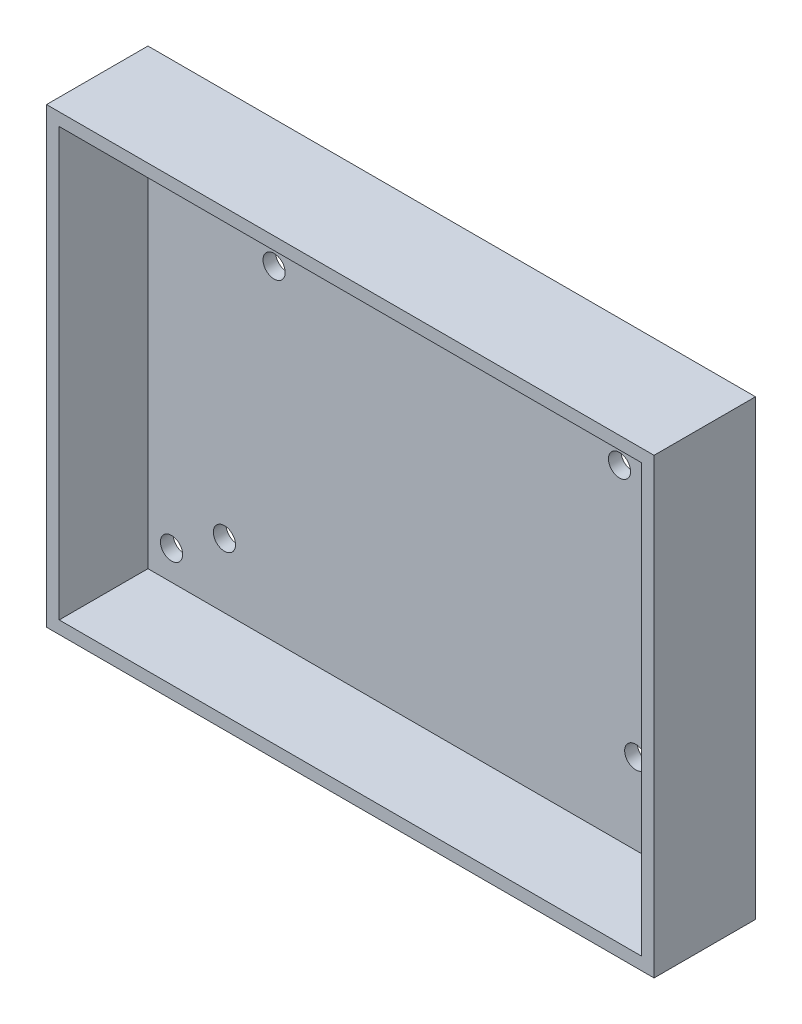
ISO-10303-21;
HEADER;
FILE_DESCRIPTION(('STEP AP214'),'2;1');
FILE_NAME('part.step','',(''),(''),'','','');
FILE_SCHEMA(('AUTOMOTIVE_DESIGN { 1 0 10303 214 1 1 1 1 }'));
ENDSEC;
DATA;
#1=APPLICATION_CONTEXT('core data for automotive mechanical design processes');
#2=APPLICATION_PROTOCOL_DEFINITION('international standard','automotive_design',2000,#1);
#3=PRODUCT_CONTEXT('',#1,'mechanical');
#4=PRODUCT('Part','Part','',(#3));
#5=PRODUCT_RELATED_PRODUCT_CATEGORY('part','',(#4));
#6=PRODUCT_DEFINITION_FORMATION('','',#4);
#7=PRODUCT_DEFINITION_CONTEXT('part definition',#1,'design');
#8=PRODUCT_DEFINITION('design','',#6,#7);
#9=PRODUCT_DEFINITION_SHAPE('','',#8);
#10=(LENGTH_UNIT() NAMED_UNIT(*) SI_UNIT(.MILLI.,.METRE.));
#11=(NAMED_UNIT(*) PLANE_ANGLE_UNIT() SI_UNIT($,.RADIAN.));
#12=(NAMED_UNIT(*) SI_UNIT($,.STERADIAN.) SOLID_ANGLE_UNIT());
#13=UNCERTAINTY_MEASURE_WITH_UNIT(LENGTH_MEASURE(1.E-05),#10,'distance_accuracy_value','');
#14=(GEOMETRIC_REPRESENTATION_CONTEXT(3) GLOBAL_UNCERTAINTY_ASSIGNED_CONTEXT((#13)) GLOBAL_UNIT_ASSIGNED_CONTEXT((#10,
#11,#12)) REPRESENTATION_CONTEXT('',''));
#15=CARTESIAN_POINT('',(0.,0.,0.));
#16=DIRECTION('',(0.,0.,1.));
#17=DIRECTION('',(1.,0.,0.));
#18=AXIS2_PLACEMENT_3D('',#15,#16,#17);
#19=CARTESIAN_POINT('',(259.442010442395,0.,4.));
#20=DIRECTION('',(1.,0.,0.));
#21=DIRECTION('',(0.,0.,-1.));
#22=AXIS2_PLACEMENT_3D('',#19,#20,#21);
#23=PLANE('',#22);
#24=DIRECTION('',(0.,-1.,0.));
#25=VECTOR('',#24,1.);
#26=CARTESIAN_POINT('',(259.442010442395,0.,0.));
#27=LINE('',#26,#25);
#28=CARTESIAN_POINT('',(259.442010442395,69.8459266842503,0.));
#29=VERTEX_POINT('',#28);
#30=CARTESIAN_POINT('',(259.442010442395,-73.,0.));
#31=VERTEX_POINT('',#30);
#32=EDGE_CURVE('E199',#29,#31,#27,.T.);
#33=ORIENTED_EDGE('',*,*,#32,.F.);
#34=DIRECTION('',(0.,0.,-1.));
#35=VECTOR('',#34,1.);
#36=CARTESIAN_POINT('',(259.442010442395,69.8459266842503,4.));
#37=LINE('',#36,#35);
#38=CARTESIAN_POINT('',(259.442010442395,69.8459266842503,32.));
#39=VERTEX_POINT('',#38);
#40=EDGE_CURVE('E11',#39,#29,#37,.T.);
#41=ORIENTED_EDGE('',*,*,#40,.F.);
#42=DIRECTION('',(0.,-1.,0.));
#43=VECTOR('',#42,1.);
#44=CARTESIAN_POINT('',(259.442010442395,0.,32.));
#45=LINE('',#44,#43);
#46=CARTESIAN_POINT('',(259.442010442395,-73.,32.));
#47=VERTEX_POINT('',#46);
#48=EDGE_CURVE('E127',#39,#47,#45,.T.);
#49=ORIENTED_EDGE('',*,*,#48,.T.);
#50=DIRECTION('',(0.,0.,-1.));
#51=VECTOR('',#50,1.);
#52=CARTESIAN_POINT('',(259.442010442395,-73.,4.));
#53=LINE('',#52,#51);
#54=EDGE_CURVE('E55',#47,#31,#53,.T.);
#55=ORIENTED_EDGE('',*,*,#54,.T.);
#56=EDGE_LOOP('',(#33,#41,#49,#55));
#57=FACE_BOUND('',#56,.T.);
#58=ADVANCED_FACE('F32',(#57),#23,.T.);
#59=CARTESIAN_POINT('',(0.,69.8459266842503,4.));
#60=DIRECTION('',(0.,1.,0.));
#61=DIRECTION('',(0.,0.,1.));
#62=AXIS2_PLACEMENT_3D('',#59,#60,#61);
#63=PLANE('',#62);
#64=DIRECTION('',(1.,0.,0.));
#65=VECTOR('',#64,1.);
#66=CARTESIAN_POINT('',(0.,69.8459266842503,0.));
#67=LINE('',#66,#65);
#68=CARTESIAN_POINT('',(67.7326460465509,69.8459266842503,0.));
#69=VERTEX_POINT('',#68);
#70=EDGE_CURVE('E202',#69,#29,#67,.T.);
#71=ORIENTED_EDGE('',*,*,#70,.F.);
#72=DIRECTION('',(0.,0.,-1.));
#73=VECTOR('',#72,1.);
#74=CARTESIAN_POINT('',(67.7326460465509,69.8459266842503,4.));
#75=LINE('',#74,#73);
#76=CARTESIAN_POINT('',(67.7326460465509,69.8459266842503,32.));
#77=VERTEX_POINT('',#76);
#78=EDGE_CURVE('E40',#77,#69,#75,.T.);
#79=ORIENTED_EDGE('',*,*,#78,.F.);
#80=DIRECTION('',(1.,0.,0.));
#81=VECTOR('',#80,1.);
#82=CARTESIAN_POINT('',(0.,69.8459266842503,32.));
#83=LINE('',#82,#81);
#84=EDGE_CURVE('E129',#77,#39,#83,.T.);
#85=ORIENTED_EDGE('',*,*,#84,.T.);
#86=ORIENTED_EDGE('',*,*,#40,.T.);
#87=EDGE_LOOP('',(#71,#79,#85,#86));
#88=FACE_BOUND('',#87,.T.);
#89=ADVANCED_FACE('F221',(#88),#63,.T.);
#90=CARTESIAN_POINT('',(67.7326460465509,0.,4.));
#91=DIRECTION('',(1.,0.,0.));
#92=DIRECTION('',(0.,1.,0.));
#93=AXIS2_PLACEMENT_3D('',#90,#91,#92);
#94=PLANE('',#93);
#95=DIRECTION('',(0.,-1.,0.));
#96=VECTOR('',#95,1.);
#97=CARTESIAN_POINT('',(67.7326460465509,0.,0.));
#98=LINE('',#97,#96);
#99=CARTESIAN_POINT('',(67.732646046551,-73.,0.));
#100=VERTEX_POINT('',#99);
#101=EDGE_CURVE('E205',#69,#100,#98,.T.);
#102=ORIENTED_EDGE('',*,*,#101,.T.);
#103=DIRECTION('',(0.,0.,-1.));
#104=VECTOR('',#103,1.);
#105=CARTESIAN_POINT('',(67.732646046551,-73.,4.));
#106=LINE('',#105,#104);
#107=CARTESIAN_POINT('',(67.732646046551,-73.,32.));
#108=VERTEX_POINT('',#107);
#109=EDGE_CURVE('E210',#108,#100,#106,.T.);
#110=ORIENTED_EDGE('',*,*,#109,.F.);
#111=DIRECTION('',(0.,-1.,0.));
#112=VECTOR('',#111,1.);
#113=CARTESIAN_POINT('',(67.7326460465509,0.,32.));
#114=LINE('',#113,#112);
#115=EDGE_CURVE('E132',#77,#108,#114,.T.);
#116=ORIENTED_EDGE('',*,*,#115,.F.);
#117=ORIENTED_EDGE('',*,*,#78,.T.);
#118=EDGE_LOOP('',(#102,#110,#116,#117));
#119=FACE_BOUND('',#118,.T.);
#120=ADVANCED_FACE('F215',(#119),#94,.F.);
#121=CARTESIAN_POINT('',(94.9732218432676,44.7663416960383,4.));
#122=DIRECTION('',(0.,0.,-1.));
#123=DIRECTION('',(-1.,0.,0.));
#124=AXIS2_PLACEMENT_3D('',#121,#122,#123);
#125=CYLINDRICAL_SURFACE('',#124,3.50000000000005);
#126=CARTESIAN_POINT('',(94.9732218432676,44.7663416960383,4.));
#127=DIRECTION('',(0.,0.,1.));
#128=DIRECTION('',(1.,0.,0.));
#129=AXIS2_PLACEMENT_3D('',#126,#127,#128);
#130=CIRCLE('',#129,3.50000000000005);
#131=CARTESIAN_POINT('',(98.4732218432676,44.7663416960383,4.));
#132=VERTEX_POINT('',#131);
#133=EDGE_CURVE('E173',#132,#132,#130,.T.);
#134=ORIENTED_EDGE('',*,*,#133,.T.);
#135=EDGE_LOOP('',(#134));
#136=FACE_BOUND('',#135,.T.);
#137=CARTESIAN_POINT('',(94.9732218432676,44.7663416960383,0.));
#138=DIRECTION('',(0.,0.,1.));
#139=DIRECTION('',(1.,0.,0.));
#140=AXIS2_PLACEMENT_3D('',#137,#138,#139);
#141=CIRCLE('',#140,3.50000000000005);
#142=CARTESIAN_POINT('',(98.4732218432676,44.7663416960383,0.));
#143=VERTEX_POINT('',#142);
#144=EDGE_CURVE('E196',#143,#143,#141,.T.);
#145=ORIENTED_EDGE('',*,*,#144,.F.);
#146=EDGE_LOOP('',(#145));
#147=FACE_BOUND('',#146,.T.);
#148=ADVANCED_FACE('F231',(#136,#147),#125,.F.);
#149=CARTESIAN_POINT('',(111.546962378698,33.5720965377341,4.));
#150=DIRECTION('',(0.,0.,-1.));
#151=DIRECTION('',(-1.,0.,0.));
#152=AXIS2_PLACEMENT_3D('',#149,#150,#151);
#153=CYLINDRICAL_SURFACE('',#152,3.49999999999999);
#154=CARTESIAN_POINT('',(111.546962378698,33.5720965377341,4.));
#155=DIRECTION('',(0.,0.,1.));
#156=DIRECTION('',(1.,0.,0.));
#157=AXIS2_PLACEMENT_3D('',#154,#155,#156);
#158=CIRCLE('',#157,3.49999999999999);
#159=CARTESIAN_POINT('',(115.046962378698,33.5720965377341,4.));
#160=VERTEX_POINT('',#159);
#161=EDGE_CURVE('E170',#160,#160,#158,.T.);
#162=ORIENTED_EDGE('',*,*,#161,.T.);
#163=EDGE_LOOP('',(#162));
#164=FACE_BOUND('',#163,.T.);
#165=CARTESIAN_POINT('',(111.546962378698,33.5720965377341,0.));
#166=DIRECTION('',(0.,0.,1.));
#167=DIRECTION('',(1.,0.,0.));
#168=AXIS2_PLACEMENT_3D('',#165,#166,#167);
#169=CIRCLE('',#168,3.49999999999999);
#170=CARTESIAN_POINT('',(115.046962378698,33.5720965377341,0.));
#171=VERTEX_POINT('',#170);
#172=EDGE_CURVE('E193',#171,#171,#169,.T.);
#173=ORIENTED_EDGE('',*,*,#172,.F.);
#174=EDGE_LOOP('',(#173));
#175=FACE_BOUND('',#174,.T.);
#176=ADVANCED_FACE('F234',(#164,#175),#153,.F.);
#177=CARTESIAN_POINT('',(220.528931490542,33.6859814718858,4.));
#178=DIRECTION('',(0.,0.,-1.));
#179=DIRECTION('',(-1.,0.,0.));
#180=AXIS2_PLACEMENT_3D('',#177,#178,#179);
#181=CYLINDRICAL_SURFACE('',#180,3.49999999999999);
#182=CARTESIAN_POINT('',(220.528931490542,33.6859814718858,4.));
#183=DIRECTION('',(0.,0.,1.));
#184=DIRECTION('',(1.,0.,0.));
#185=AXIS2_PLACEMENT_3D('',#182,#183,#184);
#186=CIRCLE('',#185,3.49999999999999);
#187=CARTESIAN_POINT('',(224.028931490542,33.6859814718858,4.));
#188=VERTEX_POINT('',#187);
#189=EDGE_CURVE('E167',#188,#188,#186,.T.);
#190=ORIENTED_EDGE('',*,*,#189,.T.);
#191=EDGE_LOOP('',(#190));
#192=FACE_BOUND('',#191,.T.);
#193=CARTESIAN_POINT('',(220.528931490542,33.6859814718858,0.));
#194=DIRECTION('',(0.,0.,1.));
#195=DIRECTION('',(1.,0.,0.));
#196=AXIS2_PLACEMENT_3D('',#193,#194,#195);
#197=CIRCLE('',#196,3.49999999999999);
#198=CARTESIAN_POINT('',(224.028931490542,33.6859814718858,0.));
#199=VERTEX_POINT('',#198);
#200=EDGE_CURVE('E190',#199,#199,#197,.T.);
#201=ORIENTED_EDGE('',*,*,#200,.F.);
#202=EDGE_LOOP('',(#201));
#203=FACE_BOUND('',#202,.T.);
#204=ADVANCED_FACE('F238',(#192,#203),#181,.F.);
#205=CARTESIAN_POINT('',(237.216888789833,44.7092333141085,4.));
#206=DIRECTION('',(0.,0.,-1.));
#207=DIRECTION('',(-1.,0.,0.));
#208=AXIS2_PLACEMENT_3D('',#205,#206,#207);
#209=CYLINDRICAL_SURFACE('',#208,3.49999999999994);
#210=CARTESIAN_POINT('',(237.216888789833,44.7092333141085,4.));
#211=DIRECTION('',(0.,0.,1.));
#212=DIRECTION('',(1.,0.,0.));
#213=AXIS2_PLACEMENT_3D('',#210,#211,#212);
#214=CIRCLE('',#213,3.49999999999994);
#215=CARTESIAN_POINT('',(240.716888789832,44.7092333141085,4.));
#216=VERTEX_POINT('',#215);
#217=EDGE_CURVE('E164',#216,#216,#214,.T.);
#218=ORIENTED_EDGE('',*,*,#217,.T.);
#219=EDGE_LOOP('',(#218));
#220=FACE_BOUND('',#219,.T.);
#221=CARTESIAN_POINT('',(237.216888789833,44.7092333141085,0.));
#222=DIRECTION('',(0.,0.,1.));
#223=DIRECTION('',(1.,0.,0.));
#224=AXIS2_PLACEMENT_3D('',#221,#222,#223);
#225=CIRCLE('',#224,3.49999999999994);
#226=CARTESIAN_POINT('',(240.716888789832,44.7092333141085,0.));
#227=VERTEX_POINT('',#226);
#228=EDGE_CURVE('E187',#227,#227,#225,.T.);
#229=ORIENTED_EDGE('',*,*,#228,.F.);
#230=EDGE_LOOP('',(#229));
#231=FACE_BOUND('',#230,.T.);
#232=ADVANCED_FACE('F242',(#220,#231),#209,.F.);
#233=CARTESIAN_POINT('',(225.662040667968,-43.5035738517174,4.));
#234=DIRECTION('',(0.,0.,-1.));
#235=DIRECTION('',(-1.,0.,0.));
#236=AXIS2_PLACEMENT_3D('',#233,#234,#235);
#237=CYLINDRICAL_SURFACE('',#236,3.49999999999999);
#238=CARTESIAN_POINT('',(225.662040667968,-43.5035738517174,4.));
#239=DIRECTION('',(0.,0.,1.));
#240=DIRECTION('',(1.,0.,0.));
#241=AXIS2_PLACEMENT_3D('',#238,#239,#240);
#242=CIRCLE('',#241,3.49999999999999);
#243=CARTESIAN_POINT('',(229.162040667968,-43.5035738517174,4.));
#244=VERTEX_POINT('',#243);
#245=EDGE_CURVE('E161',#244,#244,#242,.T.);
#246=ORIENTED_EDGE('',*,*,#245,.T.);
#247=EDGE_LOOP('',(#246));
#248=FACE_BOUND('',#247,.T.);
#249=CARTESIAN_POINT('',(225.662040667968,-43.5035738517174,0.));
#250=DIRECTION('',(0.,0.,1.));
#251=DIRECTION('',(1.,0.,0.));
#252=AXIS2_PLACEMENT_3D('',#249,#250,#251);
#253=CIRCLE('',#252,3.49999999999999);
#254=CARTESIAN_POINT('',(229.162040667968,-43.5035738517174,0.));
#255=VERTEX_POINT('',#254);
#256=EDGE_CURVE('E184',#255,#255,#253,.T.);
#257=ORIENTED_EDGE('',*,*,#256,.F.);
#258=EDGE_LOOP('',(#257));
#259=FACE_BOUND('',#258,.T.);
#260=ADVANCED_FACE('F246',(#248,#259),#237,.F.);
#261=CARTESIAN_POINT('',(242.235781203399,-54.6978190100216,4.));
#262=DIRECTION('',(0.,0.,-1.));
#263=DIRECTION('',(-1.,0.,0.));
#264=AXIS2_PLACEMENT_3D('',#261,#262,#263);
#265=CYLINDRICAL_SURFACE('',#264,3.49999999999994);
#266=CARTESIAN_POINT('',(242.235781203399,-54.6978190100216,4.));
#267=DIRECTION('',(0.,0.,1.));
#268=DIRECTION('',(1.,0.,0.));
#269=AXIS2_PLACEMENT_3D('',#266,#267,#268);
#270=CIRCLE('',#269,3.49999999999994);
#271=CARTESIAN_POINT('',(245.735781203399,-54.6978190100216,4.));
#272=VERTEX_POINT('',#271);
#273=EDGE_CURVE('E158',#272,#272,#270,.T.);
#274=ORIENTED_EDGE('',*,*,#273,.T.);
#275=EDGE_LOOP('',(#274));
#276=FACE_BOUND('',#275,.T.);
#277=CARTESIAN_POINT('',(242.235781203399,-54.6978190100216,0.));
#278=DIRECTION('',(0.,0.,1.));
#279=DIRECTION('',(1.,0.,0.));
#280=AXIS2_PLACEMENT_3D('',#277,#278,#279);
#281=CIRCLE('',#280,3.49999999999994);
#282=CARTESIAN_POINT('',(245.735781203399,-54.6978190100216,0.));
#283=VERTEX_POINT('',#282);
#284=EDGE_CURVE('E181',#283,#283,#281,.T.);
#285=ORIENTED_EDGE('',*,*,#284,.F.);
#286=EDGE_LOOP('',(#285));
#287=FACE_BOUND('',#286,.T.);
#288=ADVANCED_FACE('F250',(#276,#287),#265,.F.);
#289=CARTESIAN_POINT('',(95.8710176979427,-48.6569651942326,4.));
#290=DIRECTION('',(0.,0.,-1.));
#291=DIRECTION('',(-1.,0.,0.));
#292=AXIS2_PLACEMENT_3D('',#289,#290,#291);
#293=CYLINDRICAL_SURFACE('',#292,3.49999999999999);
#294=CARTESIAN_POINT('',(95.8710176979427,-48.6569651942326,4.));
#295=DIRECTION('',(0.,0.,1.));
#296=DIRECTION('',(1.,0.,0.));
#297=AXIS2_PLACEMENT_3D('',#294,#295,#296);
#298=CIRCLE('',#297,3.49999999999999);
#299=CARTESIAN_POINT('',(99.3710176979427,-48.6569651942326,4.));
#300=VERTEX_POINT('',#299);
#301=EDGE_CURVE('E154',#300,#300,#298,.T.);
#302=ORIENTED_EDGE('',*,*,#301,.T.);
#303=EDGE_LOOP('',(#302));
#304=FACE_BOUND('',#303,.T.);
#305=CARTESIAN_POINT('',(95.8710176979427,-48.6569651942326,0.));
#306=DIRECTION('',(0.,0.,1.));
#307=DIRECTION('',(1.,0.,0.));
#308=AXIS2_PLACEMENT_3D('',#305,#306,#307);
#309=CIRCLE('',#308,3.49999999999999);
#310=CARTESIAN_POINT('',(99.3710176979427,-48.6569651942326,0.));
#311=VERTEX_POINT('',#310);
#312=EDGE_CURVE('E178',#311,#311,#309,.T.);
#313=ORIENTED_EDGE('',*,*,#312,.F.);
#314=EDGE_LOOP('',(#313));
#315=FACE_BOUND('',#314,.T.);
#316=ADVANCED_FACE('F253',(#304,#315),#293,.F.);
#317=CARTESIAN_POINT('',(79.1830603986525,-59.6802170364554,4.));
#318=DIRECTION('',(0.,0.,-1.));
#319=DIRECTION('',(-1.,0.,0.));
#320=AXIS2_PLACEMENT_3D('',#317,#318,#319);
#321=CYLINDRICAL_SURFACE('',#320,3.49999999999999);
#322=CARTESIAN_POINT('',(79.1830603986525,-59.6802170364554,4.));
#323=DIRECTION('',(0.,0.,1.));
#324=DIRECTION('',(1.,0.,0.));
#325=AXIS2_PLACEMENT_3D('',#322,#323,#324);
#326=CIRCLE('',#325,3.49999999999999);
#327=CARTESIAN_POINT('',(82.6830603986525,-59.6802170364554,4.));
#328=VERTEX_POINT('',#327);
#329=EDGE_CURVE('E151',#328,#328,#326,.T.);
#330=ORIENTED_EDGE('',*,*,#329,.T.);
#331=EDGE_LOOP('',(#330));
#332=FACE_BOUND('',#331,.T.);
#333=CARTESIAN_POINT('',(79.1830603986525,-59.6802170364554,0.));
#334=DIRECTION('',(0.,0.,1.));
#335=DIRECTION('',(1.,0.,0.));
#336=AXIS2_PLACEMENT_3D('',#333,#334,#335);
#337=CIRCLE('',#336,3.49999999999999);
#338=CARTESIAN_POINT('',(82.6830603986525,-59.6802170364554,0.));
#339=VERTEX_POINT('',#338);
#340=EDGE_CURVE('E150',#339,#339,#337,.T.);
#341=ORIENTED_EDGE('',*,*,#340,.F.);
#342=EDGE_LOOP('',(#341));
#343=FACE_BOUND('',#342,.T.);
#344=ADVANCED_FACE('F34',(#332,#343),#321,.F.);
#345=CARTESIAN_POINT('',(0.,-73.,4.));
#346=DIRECTION('',(0.,1.,0.));
#347=DIRECTION('',(-1.,0.,0.));
#348=AXIS2_PLACEMENT_3D('',#345,#346,#347);
#349=PLANE('',#348);
#350=DIRECTION('',(1.,0.,0.));
#351=VECTOR('',#350,1.);
#352=CARTESIAN_POINT('',(0.,-73.,0.));
#353=LINE('',#352,#351);
#354=EDGE_CURVE('E155',#100,#31,#353,.T.);
#355=ORIENTED_EDGE('',*,*,#354,.T.);
#356=ORIENTED_EDGE('',*,*,#54,.F.);
#357=DIRECTION('',(1.,0.,0.));
#358=VECTOR('',#357,1.);
#359=CARTESIAN_POINT('',(0.,-73.,32.));
#360=LINE('',#359,#358);
#361=EDGE_CURVE('E135',#108,#47,#360,.T.);
#362=ORIENTED_EDGE('',*,*,#361,.F.);
#363=ORIENTED_EDGE('',*,*,#109,.T.);
#364=EDGE_LOOP('',(#355,#356,#362,#363));
#365=FACE_BOUND('',#364,.T.);
#366=ADVANCED_FACE('F260',(#365),#349,.F.);
#367=CARTESIAN_POINT('',(0.,0.,4.));
#368=DIRECTION('',(0.,0.,1.));
#369=DIRECTION('',(1.,0.,0.));
#370=AXIS2_PLACEMENT_3D('',#367,#368,#369);
#371=PLANE('',#370);
#372=DIRECTION('',(0.,-1.,0.));
#373=VECTOR('',#372,1.);
#374=CARTESIAN_POINT('',(255.442010442395,0.,4.));
#375=LINE('',#374,#373);
#376=CARTESIAN_POINT('',(255.442010442395,65.8459266842503,4.));
#377=VERTEX_POINT('',#376);
#378=CARTESIAN_POINT('',(255.442010442395,-69.,4.));
#379=VERTEX_POINT('',#378);
#380=EDGE_CURVE('E104',#377,#379,#375,.T.);
#381=ORIENTED_EDGE('',*,*,#380,.F.);
#382=DIRECTION('',(-1.,0.,0.));
#383=VECTOR('',#382,1.);
#384=CARTESIAN_POINT('',(0.,65.8459266842503,4.));
#385=LINE('',#384,#383);
#386=CARTESIAN_POINT('',(71.732646046551,65.8459266842503,4.));
#387=VERTEX_POINT('',#386);
#388=EDGE_CURVE('E108',#377,#387,#385,.T.);
#389=ORIENTED_EDGE('',*,*,#388,.T.);
#390=DIRECTION('',(0.,-1.,0.));
#391=VECTOR('',#390,1.);
#392=CARTESIAN_POINT('',(71.732646046551,0.,4.));
#393=LINE('',#392,#391);
#394=CARTESIAN_POINT('',(71.732646046551,-69.,4.));
#395=VERTEX_POINT('',#394);
#396=EDGE_CURVE('E144',#387,#395,#393,.T.);
#397=ORIENTED_EDGE('',*,*,#396,.T.);
#398=DIRECTION('',(-1.,0.,0.));
#399=VECTOR('',#398,1.);
#400=CARTESIAN_POINT('',(0.,-69.,4.));
#401=LINE('',#400,#399);
#402=EDGE_CURVE('E147',#379,#395,#401,.T.);
#403=ORIENTED_EDGE('',*,*,#402,.F.);
#404=EDGE_LOOP('',(#381,#389,#397,#403));
#405=FACE_BOUND('',#404,.T.);
#406=ORIENTED_EDGE('',*,*,#329,.F.);
#407=EDGE_LOOP('',(#406));
#408=FACE_BOUND('',#407,.T.);
#409=ORIENTED_EDGE('',*,*,#301,.F.);
#410=EDGE_LOOP('',(#409));
#411=FACE_BOUND('',#410,.T.);
#412=ORIENTED_EDGE('',*,*,#273,.F.);
#413=EDGE_LOOP('',(#412));
#414=FACE_BOUND('',#413,.T.);
#415=ORIENTED_EDGE('',*,*,#245,.F.);
#416=EDGE_LOOP('',(#415));
#417=FACE_BOUND('',#416,.T.);
#418=ORIENTED_EDGE('',*,*,#217,.F.);
#419=EDGE_LOOP('',(#418));
#420=FACE_BOUND('',#419,.T.);
#421=ORIENTED_EDGE('',*,*,#189,.F.);
#422=EDGE_LOOP('',(#421));
#423=FACE_BOUND('',#422,.T.);
#424=ORIENTED_EDGE('',*,*,#161,.F.);
#425=EDGE_LOOP('',(#424));
#426=FACE_BOUND('',#425,.T.);
#427=ORIENTED_EDGE('',*,*,#133,.F.);
#428=EDGE_LOOP('',(#427));
#429=FACE_BOUND('',#428,.T.);
#430=ADVANCED_FACE('F268',(#405,#408,#411,#414,#417,#420,#423,#426,#429),#371,.T.);
#431=CARTESIAN_POINT('',(0.,0.,0.));
#432=DIRECTION('',(0.,0.,1.));
#433=DIRECTION('',(1.,0.,0.));
#434=AXIS2_PLACEMENT_3D('',#431,#432,#433);
#435=PLANE('',#434);
#436=ORIENTED_EDGE('',*,*,#340,.T.);
#437=EDGE_LOOP('',(#436));
#438=FACE_BOUND('',#437,.T.);
#439=ORIENTED_EDGE('',*,*,#312,.T.);
#440=EDGE_LOOP('',(#439));
#441=FACE_BOUND('',#440,.T.);
#442=ORIENTED_EDGE('',*,*,#284,.T.);
#443=EDGE_LOOP('',(#442));
#444=FACE_BOUND('',#443,.T.);
#445=ORIENTED_EDGE('',*,*,#256,.T.);
#446=EDGE_LOOP('',(#445));
#447=FACE_BOUND('',#446,.T.);
#448=ORIENTED_EDGE('',*,*,#228,.T.);
#449=EDGE_LOOP('',(#448));
#450=FACE_BOUND('',#449,.T.);
#451=ORIENTED_EDGE('',*,*,#200,.T.);
#452=EDGE_LOOP('',(#451));
#453=FACE_BOUND('',#452,.T.);
#454=ORIENTED_EDGE('',*,*,#172,.T.);
#455=EDGE_LOOP('',(#454));
#456=FACE_BOUND('',#455,.T.);
#457=ORIENTED_EDGE('',*,*,#144,.T.);
#458=EDGE_LOOP('',(#457));
#459=FACE_BOUND('',#458,.T.);
#460=ORIENTED_EDGE('',*,*,#32,.T.);
#461=ORIENTED_EDGE('',*,*,#354,.F.);
#462=ORIENTED_EDGE('',*,*,#101,.F.);
#463=ORIENTED_EDGE('',*,*,#70,.T.);
#464=EDGE_LOOP('',(#460,#461,#462,#463));
#465=FACE_BOUND('',#464,.T.);
#466=ADVANCED_FACE('F220',(#438,#441,#444,#447,#450,#453,#456,#459,#465),#435,.F.);
#467=CARTESIAN_POINT('',(255.442010442395,0.,32.));
#468=DIRECTION('',(-1.,0.,0.));
#469=DIRECTION('',(0.,0.,1.));
#470=AXIS2_PLACEMENT_3D('',#467,#468,#469);
#471=PLANE('',#470);
#472=DIRECTION('',(0.,0.,-1.));
#473=VECTOR('',#472,1.);
#474=CARTESIAN_POINT('',(255.442010442395,65.8459266842503,32.));
#475=LINE('',#474,#473);
#476=CARTESIAN_POINT('',(255.442010442395,65.8459266842503,32.));
#477=VERTEX_POINT('',#476);
#478=EDGE_CURVE('E138',#477,#377,#475,.T.);
#479=ORIENTED_EDGE('',*,*,#478,.T.);
#480=ORIENTED_EDGE('',*,*,#380,.T.);
#481=DIRECTION('',(0.,0.,-1.));
#482=VECTOR('',#481,1.);
#483=CARTESIAN_POINT('',(255.442010442395,-69.,32.));
#484=LINE('',#483,#482);
#485=CARTESIAN_POINT('',(255.442010442395,-69.,32.));
#486=VERTEX_POINT('',#485);
#487=EDGE_CURVE('E98',#486,#379,#484,.T.);
#488=ORIENTED_EDGE('',*,*,#487,.F.);
#489=DIRECTION('',(0.,1.,0.));
#490=VECTOR('',#489,1.);
#491=CARTESIAN_POINT('',(255.442010442395,0.,32.));
#492=LINE('',#491,#490);
#493=EDGE_CURVE('E102',#486,#477,#492,.T.);
#494=ORIENTED_EDGE('',*,*,#493,.T.);
#495=EDGE_LOOP('',(#479,#480,#488,#494));
#496=FACE_BOUND('',#495,.T.);
#497=ADVANCED_FACE('F101',(#496),#471,.T.);
#498=CARTESIAN_POINT('',(0.,-69.,32.));
#499=DIRECTION('',(0.,1.,0.));
#500=DIRECTION('',(0.,0.,1.));
#501=AXIS2_PLACEMENT_3D('',#498,#499,#500);
#502=PLANE('',#501);
#503=ORIENTED_EDGE('',*,*,#487,.T.);
#504=ORIENTED_EDGE('',*,*,#402,.T.);
#505=DIRECTION('',(0.,0.,-1.));
#506=VECTOR('',#505,1.);
#507=CARTESIAN_POINT('',(71.732646046551,-69.,32.));
#508=LINE('',#507,#506);
#509=CARTESIAN_POINT('',(71.732646046551,-69.,32.));
#510=VERTEX_POINT('',#509);
#511=EDGE_CURVE('E109',#510,#395,#508,.T.);
#512=ORIENTED_EDGE('',*,*,#511,.F.);
#513=DIRECTION('',(1.,0.,0.));
#514=VECTOR('',#513,1.);
#515=CARTESIAN_POINT('',(0.,-69.,32.));
#516=LINE('',#515,#514);
#517=EDGE_CURVE('E115',#510,#486,#516,.T.);
#518=ORIENTED_EDGE('',*,*,#517,.T.);
#519=EDGE_LOOP('',(#503,#504,#512,#518));
#520=FACE_BOUND('',#519,.T.);
#521=ADVANCED_FACE('F119',(#520),#502,.T.);
#522=CARTESIAN_POINT('',(71.732646046551,0.,32.));
#523=DIRECTION('',(-1.,0.,0.));
#524=DIRECTION('',(0.,0.,1.));
#525=AXIS2_PLACEMENT_3D('',#522,#523,#524);
#526=PLANE('',#525);
#527=ORIENTED_EDGE('',*,*,#396,.F.);
#528=DIRECTION('',(0.,0.,-1.));
#529=VECTOR('',#528,1.);
#530=CARTESIAN_POINT('',(71.732646046551,65.8459266842503,32.));
#531=LINE('',#530,#529);
#532=CARTESIAN_POINT('',(71.732646046551,65.8459266842503,32.));
#533=VERTEX_POINT('',#532);
#534=EDGE_CURVE('E47',#533,#387,#531,.T.);
#535=ORIENTED_EDGE('',*,*,#534,.F.);
#536=DIRECTION('',(0.,1.,0.));
#537=VECTOR('',#536,1.);
#538=CARTESIAN_POINT('',(71.732646046551,0.,32.));
#539=LINE('',#538,#537);
#540=EDGE_CURVE('E122',#510,#533,#539,.T.);
#541=ORIENTED_EDGE('',*,*,#540,.F.);
#542=ORIENTED_EDGE('',*,*,#511,.T.);
#543=EDGE_LOOP('',(#527,#535,#541,#542));
#544=FACE_BOUND('',#543,.T.);
#545=ADVANCED_FACE('F380',(#544),#526,.F.);
#546=CARTESIAN_POINT('',(0.,65.8459266842503,32.));
#547=DIRECTION('',(0.,1.,0.));
#548=DIRECTION('',(0.,0.,1.));
#549=AXIS2_PLACEMENT_3D('',#546,#547,#548);
#550=PLANE('',#549);
#551=ORIENTED_EDGE('',*,*,#388,.F.);
#552=ORIENTED_EDGE('',*,*,#478,.F.);
#553=DIRECTION('',(1.,0.,0.));
#554=VECTOR('',#553,1.);
#555=CARTESIAN_POINT('',(0.,65.8459266842503,32.));
#556=LINE('',#555,#554);
#557=EDGE_CURVE('E116',#533,#477,#556,.T.);
#558=ORIENTED_EDGE('',*,*,#557,.F.);
#559=ORIENTED_EDGE('',*,*,#534,.T.);
#560=EDGE_LOOP('',(#551,#552,#558,#559));
#561=FACE_BOUND('',#560,.T.);
#562=ADVANCED_FACE('F388',(#561),#550,.F.);
#563=CARTESIAN_POINT('',(0.,0.,32.));
#564=DIRECTION('',(0.,0.,1.));
#565=DIRECTION('',(1.,0.,0.));
#566=AXIS2_PLACEMENT_3D('',#563,#564,#565);
#567=PLANE('',#566);
#568=ORIENTED_EDGE('',*,*,#493,.F.);
#569=ORIENTED_EDGE('',*,*,#517,.F.);
#570=ORIENTED_EDGE('',*,*,#540,.T.);
#571=ORIENTED_EDGE('',*,*,#557,.T.);
#572=EDGE_LOOP('',(#568,#569,#570,#571));
#573=FACE_BOUND('',#572,.T.);
#574=ORIENTED_EDGE('',*,*,#48,.F.);
#575=ORIENTED_EDGE('',*,*,#84,.F.);
#576=ORIENTED_EDGE('',*,*,#115,.T.);
#577=ORIENTED_EDGE('',*,*,#361,.T.);
#578=EDGE_LOOP('',(#574,#575,#576,#577));
#579=FACE_BOUND('',#578,.T.);
#580=ADVANCED_FACE('F113',(#573,#579),#567,.T.);
#581=CLOSED_SHELL('',(#58,#89,#120,#148,#176,#204,#232,#260,#288,#316,#344,#366,#430,#466,#497,
#521,#545,#562,#580));
#582=MANIFOLD_SOLID_BREP('B2',#581);
#583=ADVANCED_BREP_SHAPE_REPRESENTATION('',(#18,#582),#14);
#584=SHAPE_DEFINITION_REPRESENTATION(#9,#583);
ENDSEC;
END-ISO-10303-21;
